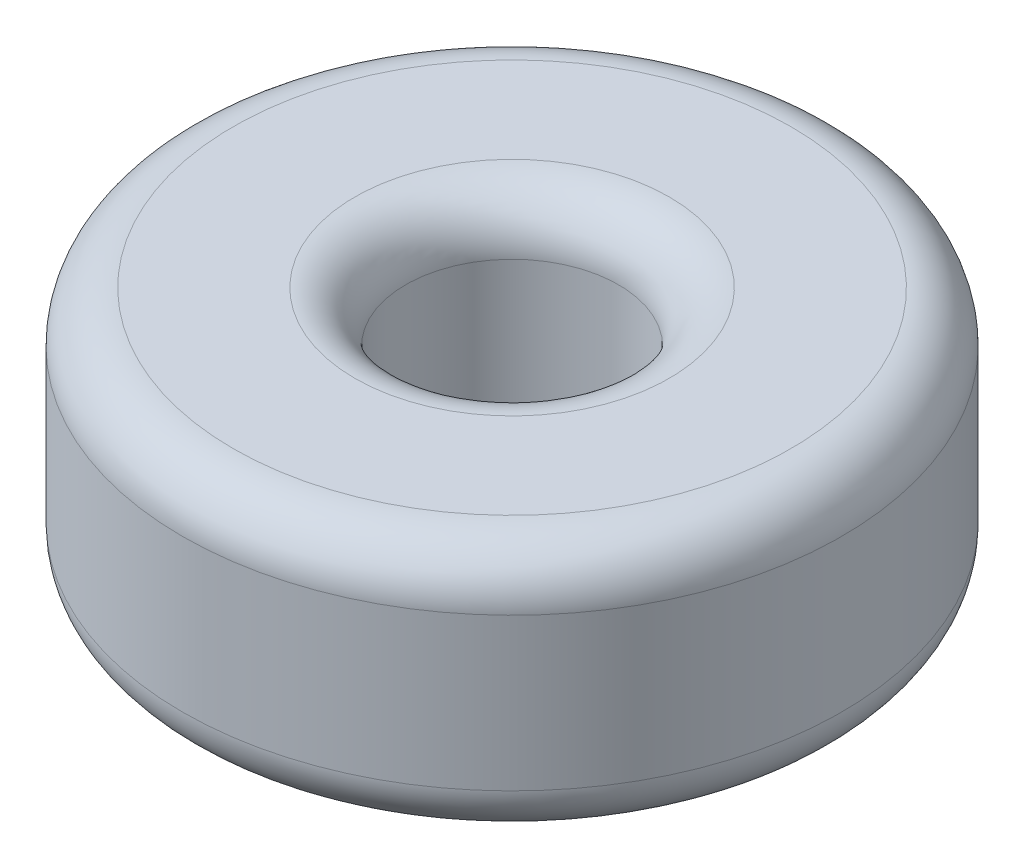
ISO-10303-21;
HEADER;
FILE_DESCRIPTION(('STEP AP214'),'2;1');
FILE_NAME('part.step','',(''),(''),'','','');
FILE_SCHEMA(('AUTOMOTIVE_DESIGN { 1 0 10303 214 1 1 1 1 }'));
ENDSEC;
DATA;
#1=APPLICATION_CONTEXT('core data for automotive mechanical design processes');
#2=APPLICATION_PROTOCOL_DEFINITION('international standard','automotive_design',2000,#1);
#3=PRODUCT_CONTEXT('',#1,'mechanical');
#4=PRODUCT('Part','Part','',(#3));
#5=PRODUCT_RELATED_PRODUCT_CATEGORY('part','',(#4));
#6=PRODUCT_DEFINITION_FORMATION('','',#4);
#7=PRODUCT_DEFINITION_CONTEXT('part definition',#1,'design');
#8=PRODUCT_DEFINITION('design','',#6,#7);
#9=PRODUCT_DEFINITION_SHAPE('','',#8);
#10=(LENGTH_UNIT() NAMED_UNIT(*) SI_UNIT(.MILLI.,.METRE.));
#11=(NAMED_UNIT(*) PLANE_ANGLE_UNIT() SI_UNIT($,.RADIAN.));
#12=(NAMED_UNIT(*) SI_UNIT($,.STERADIAN.) SOLID_ANGLE_UNIT());
#13=UNCERTAINTY_MEASURE_WITH_UNIT(LENGTH_MEASURE(1.E-05),#10,'distance_accuracy_value','');
#14=(GEOMETRIC_REPRESENTATION_CONTEXT(3) GLOBAL_UNCERTAINTY_ASSIGNED_CONTEXT((#13)) GLOBAL_UNIT_ASSIGNED_CONTEXT((#10,
#11,#12)) REPRESENTATION_CONTEXT('',''));
#15=CARTESIAN_POINT('',(0.,0.,0.));
#16=DIRECTION('',(0.,0.,1.));
#17=DIRECTION('',(1.,0.,0.));
#18=AXIS2_PLACEMENT_3D('',#15,#16,#17);
#19=CARTESIAN_POINT('',(0.,5.,0.));
#20=DIRECTION('',(0.,1.,0.));
#21=DIRECTION('',(0.,0.,1.));
#22=AXIS2_PLACEMENT_3D('',#19,#20,#21);
#23=PLANE('',#22);
#24=CARTESIAN_POINT('',(0.,5.,0.));
#25=DIRECTION('',(0.,1.,0.));
#26=DIRECTION('',(0.,0.,1.));
#27=AXIS2_PLACEMENT_3D('',#24,#25,#26);
#28=CIRCLE('',#27,3.1);
#29=CARTESIAN_POINT('',(0.,5.,3.1));
#30=VERTEX_POINT('',#29);
#31=EDGE_CURVE('E10',#30,#30,#28,.F.);
#32=ORIENTED_EDGE('',*,*,#31,.T.);
#33=EDGE_LOOP('',(#32));
#34=FACE_BOUND('',#33,.T.);
#35=CARTESIAN_POINT('',(0.,5.,0.));
#36=DIRECTION('',(0.,1.,0.));
#37=DIRECTION('',(0.,0.,1.));
#38=AXIS2_PLACEMENT_3D('',#35,#36,#37);
#39=CIRCLE('',#38,5.5);
#40=CARTESIAN_POINT('',(0.,5.,5.5));
#41=VERTEX_POINT('',#40);
#42=EDGE_CURVE('E46',#41,#41,#39,.T.);
#43=ORIENTED_EDGE('',*,*,#42,.T.);
#44=EDGE_LOOP('',(#43));
#45=FACE_BOUND('',#44,.T.);
#46=ADVANCED_FACE('F39',(#34,#45),#23,.T.);
#47=CARTESIAN_POINT('',(0.,0.,0.));
#48=DIRECTION('',(0.,1.,0.));
#49=DIRECTION('',(0.,0.,1.));
#50=AXIS2_PLACEMENT_3D('',#47,#48,#49);
#51=PLANE('',#50);
#52=CARTESIAN_POINT('',(0.,0.,0.));
#53=DIRECTION('',(0.,1.,0.));
#54=DIRECTION('',(0.,0.,1.));
#55=AXIS2_PLACEMENT_3D('',#52,#53,#54);
#56=CIRCLE('',#55,3.1);
#57=CARTESIAN_POINT('',(0.,0.,3.1));
#58=VERTEX_POINT('',#57);
#59=EDGE_CURVE('E65',#58,#58,#56,.T.);
#60=ORIENTED_EDGE('',*,*,#59,.T.);
#61=EDGE_LOOP('',(#60));
#62=FACE_BOUND('',#61,.T.);
#63=CARTESIAN_POINT('',(0.,0.,0.));
#64=DIRECTION('',(0.,1.,0.));
#65=DIRECTION('',(0.,0.,1.));
#66=AXIS2_PLACEMENT_3D('',#63,#64,#65);
#67=CIRCLE('',#66,5.5);
#68=CARTESIAN_POINT('',(0.,0.,5.5));
#69=VERTEX_POINT('',#68);
#70=EDGE_CURVE('E68',#69,#69,#67,.F.);
#71=ORIENTED_EDGE('',*,*,#70,.T.);
#72=EDGE_LOOP('',(#71));
#73=FACE_BOUND('',#72,.T.);
#74=ADVANCED_FACE('F72',(#62,#73),#51,.F.);
#75=CARTESIAN_POINT('',(0.,5.,0.));
#76=DIRECTION('',(0.,-1.,0.));
#77=DIRECTION('',(0.,0.,-1.));
#78=AXIS2_PLACEMENT_3D('',#75,#76,#77);
#79=CYLINDRICAL_SURFACE('',#78,6.5);
#80=CARTESIAN_POINT('',(0.,1.,0.));
#81=DIRECTION('',(0.,1.,0.));
#82=DIRECTION('',(0.,0.,1.));
#83=AXIS2_PLACEMENT_3D('',#80,#81,#82);
#84=CIRCLE('',#83,6.5);
#85=CARTESIAN_POINT('',(0.,1.,6.5));
#86=VERTEX_POINT('',#85);
#87=EDGE_CURVE('E50',#86,#86,#84,.T.);
#88=ORIENTED_EDGE('',*,*,#87,.T.);
#89=EDGE_LOOP('',(#88));
#90=FACE_BOUND('',#89,.T.);
#91=CARTESIAN_POINT('',(0.,4.,0.));
#92=DIRECTION('',(0.,1.,0.));
#93=DIRECTION('',(0.,0.,1.));
#94=AXIS2_PLACEMENT_3D('',#91,#92,#93);
#95=CIRCLE('',#94,6.5);
#96=CARTESIAN_POINT('',(0.,4.,6.5));
#97=VERTEX_POINT('',#96);
#98=EDGE_CURVE('E54',#97,#97,#95,.F.);
#99=ORIENTED_EDGE('',*,*,#98,.T.);
#100=EDGE_LOOP('',(#99));
#101=FACE_BOUND('',#100,.T.);
#102=ADVANCED_FACE('F82',(#90,#101),#79,.T.);
#103=CARTESIAN_POINT('',(0.,5.,0.));
#104=DIRECTION('',(0.,-1.,0.));
#105=DIRECTION('',(0.,0.,-1.));
#106=AXIS2_PLACEMENT_3D('',#103,#104,#105);
#107=CYLINDRICAL_SURFACE('',#106,2.1);
#108=CARTESIAN_POINT('',(0.,1.,0.));
#109=DIRECTION('',(0.,1.,0.));
#110=DIRECTION('',(0.,0.,1.));
#111=AXIS2_PLACEMENT_3D('',#108,#109,#110);
#112=CIRCLE('',#111,2.1);
#113=CARTESIAN_POINT('',(0.,1.,2.1));
#114=VERTEX_POINT('',#113);
#115=EDGE_CURVE('E59',#114,#114,#112,.F.);
#116=ORIENTED_EDGE('',*,*,#115,.T.);
#117=EDGE_LOOP('',(#116));
#118=FACE_BOUND('',#117,.T.);
#119=CARTESIAN_POINT('',(0.,4.,0.));
#120=DIRECTION('',(0.,1.,0.));
#121=DIRECTION('',(0.,0.,1.));
#122=AXIS2_PLACEMENT_3D('',#119,#120,#121);
#123=CIRCLE('',#122,2.1);
#124=CARTESIAN_POINT('',(0.,4.,2.1));
#125=VERTEX_POINT('',#124);
#126=EDGE_CURVE('E62',#125,#125,#123,.T.);
#127=ORIENTED_EDGE('',*,*,#126,.T.);
#128=EDGE_LOOP('',(#127));
#129=FACE_BOUND('',#128,.T.);
#130=ADVANCED_FACE('F85',(#118,#129),#107,.F.);
#131=CARTESIAN_POINT('',(0.,1.,0.));
#132=DIRECTION('',(0.,1.,0.));
#133=DIRECTION('',(0.,0.,1.));
#134=AXIS2_PLACEMENT_3D('',#131,#132,#133);
#135=TOROIDAL_SURFACE('',#134,3.1,1.);
#136=ORIENTED_EDGE('',*,*,#115,.F.);
#137=EDGE_LOOP('',(#136));
#138=FACE_BOUND('',#137,.T.);
#139=ORIENTED_EDGE('',*,*,#59,.F.);
#140=EDGE_LOOP('',(#139));
#141=FACE_BOUND('',#140,.T.);
#142=ADVANCED_FACE('F78',(#138,#141),#135,.T.);
#143=CARTESIAN_POINT('',(0.,1.,0.));
#144=DIRECTION('',(0.,1.,0.));
#145=DIRECTION('',(0.,0.,1.));
#146=AXIS2_PLACEMENT_3D('',#143,#144,#145);
#147=TOROIDAL_SURFACE('',#146,5.5,1.);
#148=ORIENTED_EDGE('',*,*,#70,.F.);
#149=EDGE_LOOP('',(#148));
#150=FACE_BOUND('',#149,.T.);
#151=ORIENTED_EDGE('',*,*,#87,.F.);
#152=EDGE_LOOP('',(#151));
#153=FACE_BOUND('',#152,.T.);
#154=ADVANCED_FACE('F74',(#150,#153),#147,.T.);
#155=CARTESIAN_POINT('',(0.,4.,0.));
#156=DIRECTION('',(0.,1.,0.));
#157=DIRECTION('',(0.,0.,1.));
#158=AXIS2_PLACEMENT_3D('',#155,#156,#157);
#159=TOROIDAL_SURFACE('',#158,3.1,1.);
#160=ORIENTED_EDGE('',*,*,#31,.F.);
#161=EDGE_LOOP('',(#160));
#162=FACE_BOUND('',#161,.T.);
#163=ORIENTED_EDGE('',*,*,#126,.F.);
#164=EDGE_LOOP('',(#163));
#165=FACE_BOUND('',#164,.T.);
#166=ADVANCED_FACE('F77',(#162,#165),#159,.T.);
#167=CARTESIAN_POINT('',(0.,4.,0.));
#168=DIRECTION('',(0.,1.,0.));
#169=DIRECTION('',(0.,0.,1.));
#170=AXIS2_PLACEMENT_3D('',#167,#168,#169);
#171=TOROIDAL_SURFACE('',#170,5.5,1.);
#172=ORIENTED_EDGE('',*,*,#98,.F.);
#173=EDGE_LOOP('',(#172));
#174=FACE_BOUND('',#173,.T.);
#175=ORIENTED_EDGE('',*,*,#42,.F.);
#176=EDGE_LOOP('',(#175));
#177=FACE_BOUND('',#176,.T.);
#178=ADVANCED_FACE('F41',(#174,#177),#171,.T.);
#179=CLOSED_SHELL('',(#46,#74,#102,#130,#142,#154,#166,#178));
#180=MANIFOLD_SOLID_BREP('B2',#179);
#181=ADVANCED_BREP_SHAPE_REPRESENTATION('',(#18,#180),#14);
#182=SHAPE_DEFINITION_REPRESENTATION(#9,#181);
ENDSEC;
END-ISO-10303-21;
